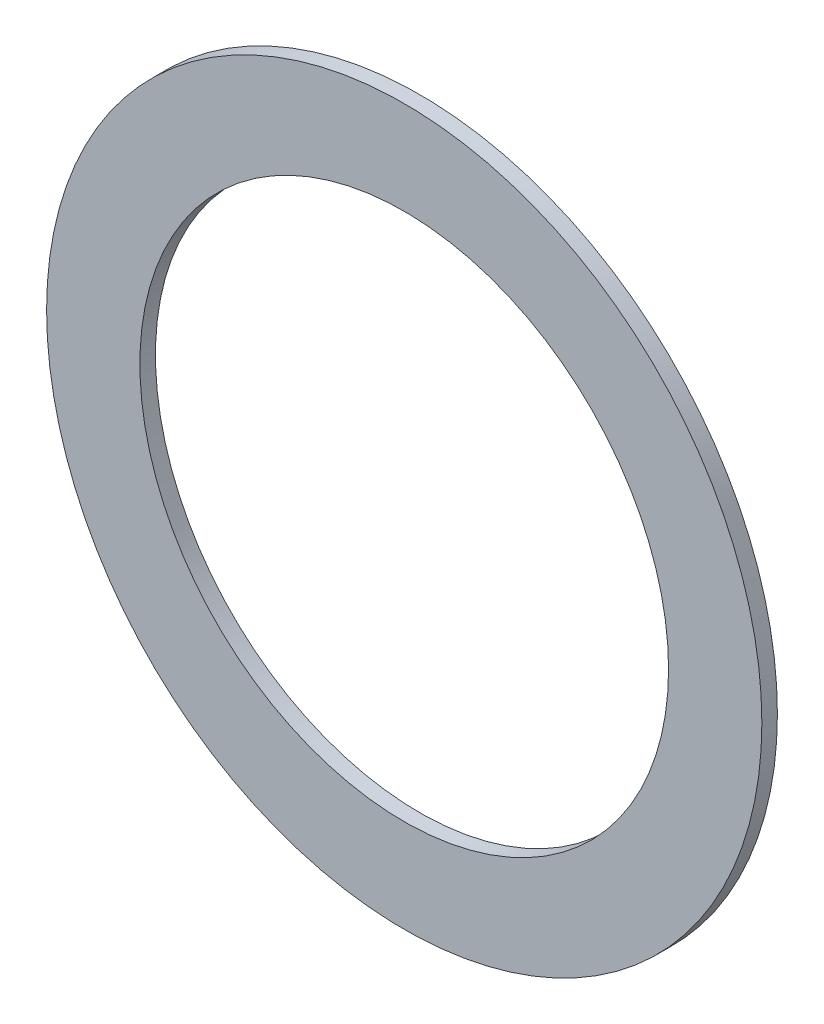
ISO-10303-21;
HEADER;
FILE_DESCRIPTION(('STEP AP214'),'2;1');
FILE_NAME('part.step','',(''),(''),'','','');
FILE_SCHEMA(('AUTOMOTIVE_DESIGN { 1 0 10303 214 1 1 1 1 }'));
ENDSEC;
DATA;
#1=APPLICATION_CONTEXT('core data for automotive mechanical design processes');
#2=APPLICATION_PROTOCOL_DEFINITION('international standard','automotive_design',2000,#1);
#3=PRODUCT_CONTEXT('',#1,'mechanical');
#4=PRODUCT('Part','Part','',(#3));
#5=PRODUCT_RELATED_PRODUCT_CATEGORY('part','',(#4));
#6=PRODUCT_DEFINITION_FORMATION('','',#4);
#7=PRODUCT_DEFINITION_CONTEXT('part definition',#1,'design');
#8=PRODUCT_DEFINITION('design','',#6,#7);
#9=PRODUCT_DEFINITION_SHAPE('','',#8);
#10=(LENGTH_UNIT() NAMED_UNIT(*) SI_UNIT(.MILLI.,.METRE.));
#11=(NAMED_UNIT(*) PLANE_ANGLE_UNIT() SI_UNIT($,.RADIAN.));
#12=(NAMED_UNIT(*) SI_UNIT($,.STERADIAN.) SOLID_ANGLE_UNIT());
#13=UNCERTAINTY_MEASURE_WITH_UNIT(LENGTH_MEASURE(1.E-05),#10,'distance_accuracy_value','');
#14=(GEOMETRIC_REPRESENTATION_CONTEXT(3) GLOBAL_UNCERTAINTY_ASSIGNED_CONTEXT((#13)) GLOBAL_UNIT_ASSIGNED_CONTEXT((#10,
#11,#12)) REPRESENTATION_CONTEXT('',''));
#15=CARTESIAN_POINT('',(0.,0.,0.));
#16=DIRECTION('',(0.,0.,1.));
#17=DIRECTION('',(1.,0.,0.));
#18=AXIS2_PLACEMENT_3D('',#15,#16,#17);
#19=CARTESIAN_POINT('',(0.,0.,2.));
#20=DIRECTION('',(0.,0.,1.));
#21=DIRECTION('',(1.,0.,0.));
#22=AXIS2_PLACEMENT_3D('',#19,#20,#21);
#23=PLANE('',#22);
#24=CARTESIAN_POINT('',(0.,0.,2.));
#25=DIRECTION('',(0.,0.,1.));
#26=DIRECTION('',(1.,0.,0.));
#27=AXIS2_PLACEMENT_3D('',#24,#25,#26);
#28=CIRCLE('',#27,46.);
#29=CARTESIAN_POINT('',(46.,0.,2.));
#30=VERTEX_POINT('',#29);
#31=EDGE_CURVE('E11',#30,#30,#28,.T.);
#32=ORIENTED_EDGE('',*,*,#31,.T.);
#33=EDGE_LOOP('',(#32));
#34=FACE_BOUND('',#33,.T.);
#35=CARTESIAN_POINT('',(0.,0.,2.));
#36=DIRECTION('',(0.,0.,1.));
#37=DIRECTION('',(1.,0.,0.));
#38=AXIS2_PLACEMENT_3D('',#35,#36,#37);
#39=CIRCLE('',#38,34.);
#40=CARTESIAN_POINT('',(34.,0.,2.));
#41=VERTEX_POINT('',#40);
#42=EDGE_CURVE('E48',#41,#41,#39,.T.);
#43=ORIENTED_EDGE('',*,*,#42,.F.);
#44=EDGE_LOOP('',(#43));
#45=FACE_BOUND('',#44,.T.);
#46=ADVANCED_FACE('F35',(#34,#45),#23,.T.);
#47=CARTESIAN_POINT('',(0.,0.,0.));
#48=DIRECTION('',(0.,0.,1.));
#49=DIRECTION('',(1.,0.,0.));
#50=AXIS2_PLACEMENT_3D('',#47,#48,#49);
#51=PLANE('',#50);
#52=CARTESIAN_POINT('',(0.,0.,0.));
#53=DIRECTION('',(0.,0.,1.));
#54=DIRECTION('',(1.,0.,0.));
#55=AXIS2_PLACEMENT_3D('',#52,#53,#54);
#56=CIRCLE('',#55,46.);
#57=CARTESIAN_POINT('',(46.,0.,0.));
#58=VERTEX_POINT('',#57);
#59=EDGE_CURVE('E39',#58,#58,#56,.T.);
#60=ORIENTED_EDGE('',*,*,#59,.F.);
#61=EDGE_LOOP('',(#60));
#62=FACE_BOUND('',#61,.T.);
#63=CARTESIAN_POINT('',(0.,0.,0.));
#64=DIRECTION('',(0.,0.,1.));
#65=DIRECTION('',(1.,0.,0.));
#66=AXIS2_PLACEMENT_3D('',#63,#64,#65);
#67=CIRCLE('',#66,34.);
#68=CARTESIAN_POINT('',(34.,0.,0.));
#69=VERTEX_POINT('',#68);
#70=EDGE_CURVE('E49',#69,#69,#67,.T.);
#71=ORIENTED_EDGE('',*,*,#70,.T.);
#72=EDGE_LOOP('',(#71));
#73=FACE_BOUND('',#72,.T.);
#74=ADVANCED_FACE('F61',(#62,#73),#51,.F.);
#75=CARTESIAN_POINT('',(0.,0.,2.));
#76=DIRECTION('',(0.,0.,-1.));
#77=DIRECTION('',(-1.,0.,0.));
#78=AXIS2_PLACEMENT_3D('',#75,#76,#77);
#79=CYLINDRICAL_SURFACE('',#78,46.);
#80=ORIENTED_EDGE('',*,*,#31,.F.);
#81=EDGE_LOOP('',(#80));
#82=FACE_BOUND('',#81,.T.);
#83=ORIENTED_EDGE('',*,*,#59,.T.);
#84=EDGE_LOOP('',(#83));
#85=FACE_BOUND('',#84,.T.);
#86=ADVANCED_FACE('F37',(#82,#85),#79,.T.);
#87=CARTESIAN_POINT('',(0.,0.,2.));
#88=DIRECTION('',(0.,0.,-1.));
#89=DIRECTION('',(-1.,0.,0.));
#90=AXIS2_PLACEMENT_3D('',#87,#88,#89);
#91=CYLINDRICAL_SURFACE('',#90,34.);
#92=ORIENTED_EDGE('',*,*,#42,.T.);
#93=EDGE_LOOP('',(#92));
#94=FACE_BOUND('',#93,.T.);
#95=ORIENTED_EDGE('',*,*,#70,.F.);
#96=EDGE_LOOP('',(#95));
#97=FACE_BOUND('',#96,.T.);
#98=ADVANCED_FACE('F57',(#94,#97),#91,.F.);
#99=CLOSED_SHELL('',(#46,#74,#86,#98));
#100=MANIFOLD_SOLID_BREP('B2',#99);
#101=ADVANCED_BREP_SHAPE_REPRESENTATION('',(#18,#100),#14);
#102=SHAPE_DEFINITION_REPRESENTATION(#9,#101);
ENDSEC;
END-ISO-10303-21;
